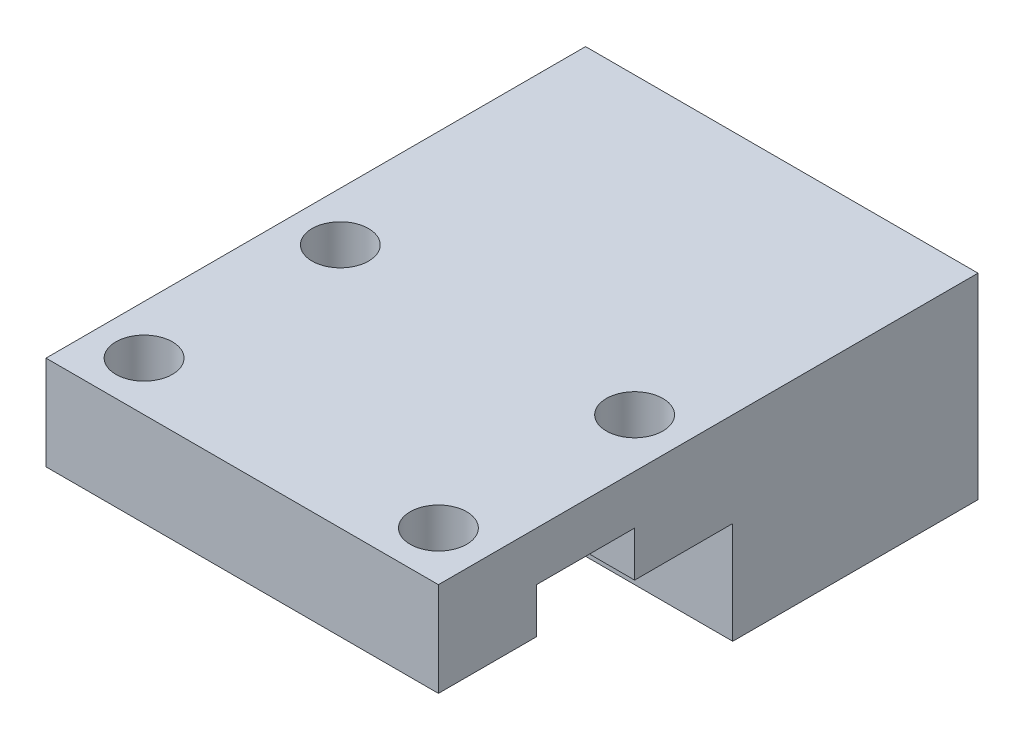
ISO-10303-21;
HEADER;
FILE_DESCRIPTION(('STEP AP214'),'2;1');
FILE_NAME('part.step','',(''),(''),'','','');
FILE_SCHEMA(('AUTOMOTIVE_DESIGN { 1 0 10303 214 1 1 1 1 }'));
ENDSEC;
DATA;
#1=APPLICATION_CONTEXT('core data for automotive mechanical design processes');
#2=APPLICATION_PROTOCOL_DEFINITION('international standard','automotive_design',2000,#1);
#3=PRODUCT_CONTEXT('',#1,'mechanical');
#4=PRODUCT('Part','Part','',(#3));
#5=PRODUCT_RELATED_PRODUCT_CATEGORY('part','',(#4));
#6=PRODUCT_DEFINITION_FORMATION('','',#4);
#7=PRODUCT_DEFINITION_CONTEXT('part definition',#1,'design');
#8=PRODUCT_DEFINITION('design','',#6,#7);
#9=PRODUCT_DEFINITION_SHAPE('','',#8);
#10=(LENGTH_UNIT() NAMED_UNIT(*) SI_UNIT(.MILLI.,.METRE.));
#11=(NAMED_UNIT(*) PLANE_ANGLE_UNIT() SI_UNIT($,.RADIAN.));
#12=(NAMED_UNIT(*) SI_UNIT($,.STERADIAN.) SOLID_ANGLE_UNIT());
#13=UNCERTAINTY_MEASURE_WITH_UNIT(LENGTH_MEASURE(1.E-05),#10,'distance_accuracy_value','');
#14=(GEOMETRIC_REPRESENTATION_CONTEXT(3) GLOBAL_UNCERTAINTY_ASSIGNED_CONTEXT((#13)) GLOBAL_UNIT_ASSIGNED_CONTEXT((#10,
#11,#12)) REPRESENTATION_CONTEXT('',''));
#15=CARTESIAN_POINT('',(0.,0.,0.));
#16=DIRECTION('',(0.,0.,1.));
#17=DIRECTION('',(1.,0.,0.));
#18=AXIS2_PLACEMENT_3D('',#15,#16,#17);
#19=CARTESIAN_POINT('',(25.4,0.,-19.05));
#20=DIRECTION('',(0.,0.,-1.));
#21=DIRECTION('',(-1.,0.,0.));
#22=AXIS2_PLACEMENT_3D('',#19,#20,#21);
#23=PLANE('',#22);
#24=DIRECTION('',(0.,-1.,0.));
#25=VECTOR('',#24,1.);
#26=CARTESIAN_POINT('',(0.,0.,-19.05));
#27=LINE('',#26,#25);
#28=CARTESIAN_POINT('',(0.,0.,-19.05));
#29=VERTEX_POINT('',#28);
#30=CARTESIAN_POINT('',(0.,-6.604,-19.05));
#31=VERTEX_POINT('',#30);
#32=EDGE_CURVE('E142',#29,#31,#27,.T.);
#33=ORIENTED_EDGE('',*,*,#32,.T.);
#34=DIRECTION('',(-1.,0.,0.));
#35=VECTOR('',#34,1.);
#36=CARTESIAN_POINT('',(25.4,-6.604,-19.05));
#37=LINE('',#36,#35);
#38=CARTESIAN_POINT('',(25.4,-6.604,-19.05));
#39=VERTEX_POINT('',#38);
#40=EDGE_CURVE('E11',#39,#31,#37,.T.);
#41=ORIENTED_EDGE('',*,*,#40,.F.);
#42=DIRECTION('',(0.,-1.,0.));
#43=VECTOR('',#42,1.);
#44=CARTESIAN_POINT('',(25.4,0.,-19.05));
#45=LINE('',#44,#43);
#46=CARTESIAN_POINT('',(25.4,0.,-19.05));
#47=VERTEX_POINT('',#46);
#48=EDGE_CURVE('E205',#47,#39,#45,.T.);
#49=ORIENTED_EDGE('',*,*,#48,.F.);
#50=DIRECTION('',(-1.,0.,0.));
#51=VECTOR('',#50,1.);
#52=CARTESIAN_POINT('',(25.4,0.,-19.05));
#53=LINE('',#52,#51);
#54=EDGE_CURVE('E137',#47,#29,#53,.T.);
#55=ORIENTED_EDGE('',*,*,#54,.T.);
#56=EDGE_LOOP('',(#33,#41,#49,#55));
#57=FACE_BOUND('',#56,.T.);
#58=ADVANCED_FACE('F35',(#57),#23,.F.);
#59=CARTESIAN_POINT('',(25.4,-6.604,0.));
#60=DIRECTION('',(0.,1.,0.));
#61=DIRECTION('',(0.,0.,1.));
#62=AXIS2_PLACEMENT_3D('',#59,#60,#61);
#63=PLANE('',#62);
#64=DIRECTION('',(0.,0.,-1.));
#65=VECTOR('',#64,1.);
#66=CARTESIAN_POINT('',(0.,-6.604,0.));
#67=LINE('',#66,#65);
#68=CARTESIAN_POINT('',(0.,-6.604,-34.925));
#69=VERTEX_POINT('',#68);
#70=EDGE_CURVE('E145',#31,#69,#67,.T.);
#71=ORIENTED_EDGE('',*,*,#70,.T.);
#72=DIRECTION('',(-1.,0.,0.));
#73=VECTOR('',#72,1.);
#74=CARTESIAN_POINT('',(25.4,-6.604,-34.925));
#75=LINE('',#74,#73);
#76=CARTESIAN_POINT('',(25.4,-6.604,-34.925));
#77=VERTEX_POINT('',#76);
#78=EDGE_CURVE('E43',#77,#69,#75,.T.);
#79=ORIENTED_EDGE('',*,*,#78,.F.);
#80=DIRECTION('',(0.,0.,-1.));
#81=VECTOR('',#80,1.);
#82=CARTESIAN_POINT('',(25.4,-6.604,0.));
#83=LINE('',#82,#81);
#84=EDGE_CURVE('E96',#39,#77,#83,.T.);
#85=ORIENTED_EDGE('',*,*,#84,.F.);
#86=ORIENTED_EDGE('',*,*,#40,.T.);
#87=EDGE_LOOP('',(#71,#79,#85,#86));
#88=FACE_BOUND('',#87,.T.);
#89=ADVANCED_FACE('F283',(#88),#63,.F.);
#90=CARTESIAN_POINT('',(25.4,0.,-34.925));
#91=DIRECTION('',(0.,0.,1.));
#92=DIRECTION('',(1.,0.,0.));
#93=AXIS2_PLACEMENT_3D('',#90,#91,#92);
#94=PLANE('',#93);
#95=CARTESIAN_POINT('',(6.35,-3.429,-34.925));
#96=DIRECTION('',(0.,0.,-1.));
#97=DIRECTION('',(-1.,0.,0.));
#98=AXIS2_PLACEMENT_3D('',#95,#96,#97);
#99=CIRCLE('',#98,1.8288);
#100=CARTESIAN_POINT('',(4.5212,-3.429,-34.925));
#101=VERTEX_POINT('',#100);
#102=EDGE_CURVE('E228',#101,#101,#99,.T.);
#103=ORIENTED_EDGE('',*,*,#102,.F.);
#104=EDGE_LOOP('',(#103));
#105=FACE_BOUND('',#104,.T.);
#106=CARTESIAN_POINT('',(19.05,-3.429,-34.925));
#107=DIRECTION('',(0.,0.,-1.));
#108=DIRECTION('',(-1.,0.,0.));
#109=AXIS2_PLACEMENT_3D('',#106,#107,#108);
#110=CIRCLE('',#109,1.8288);
#111=CARTESIAN_POINT('',(17.2212,-3.429,-34.925));
#112=VERTEX_POINT('',#111);
#113=EDGE_CURVE('E222',#112,#112,#110,.T.);
#114=ORIENTED_EDGE('',*,*,#113,.F.);
#115=EDGE_LOOP('',(#114));
#116=FACE_BOUND('',#115,.T.);
#117=CARTESIAN_POINT('',(6.35,2.921,-34.925));
#118=DIRECTION('',(0.,0.,-1.));
#119=DIRECTION('',(-1.,0.,0.));
#120=AXIS2_PLACEMENT_3D('',#117,#118,#119);
#121=CIRCLE('',#120,1.8288);
#122=CARTESIAN_POINT('',(4.5212,2.921,-34.925));
#123=VERTEX_POINT('',#122);
#124=EDGE_CURVE('E216',#123,#123,#121,.T.);
#125=ORIENTED_EDGE('',*,*,#124,.F.);
#126=EDGE_LOOP('',(#125));
#127=FACE_BOUND('',#126,.T.);
#128=CARTESIAN_POINT('',(19.05,2.921,-34.925));
#129=DIRECTION('',(0.,0.,-1.));
#130=DIRECTION('',(-1.,0.,0.));
#131=AXIS2_PLACEMENT_3D('',#128,#129,#130);
#132=CIRCLE('',#131,1.8288);
#133=CARTESIAN_POINT('',(17.2212,2.921,-34.925));
#134=VERTEX_POINT('',#133);
#135=EDGE_CURVE('E210',#134,#134,#132,.T.);
#136=ORIENTED_EDGE('',*,*,#135,.F.);
#137=EDGE_LOOP('',(#136));
#138=FACE_BOUND('',#137,.T.);
#139=DIRECTION('',(0.,1.,0.));
#140=VECTOR('',#139,1.);
#141=CARTESIAN_POINT('',(0.,0.,-34.925));
#142=LINE('',#141,#140);
#143=CARTESIAN_POINT('',(0.,6.096,-34.925));
#144=VERTEX_POINT('',#143);
#145=EDGE_CURVE('E148',#69,#144,#142,.T.);
#146=ORIENTED_EDGE('',*,*,#145,.T.);
#147=DIRECTION('',(-1.,0.,0.));
#148=VECTOR('',#147,1.);
#149=CARTESIAN_POINT('',(25.4,6.096,-34.925));
#150=LINE('',#149,#148);
#151=CARTESIAN_POINT('',(25.4,6.096,-34.925));
#152=VERTEX_POINT('',#151);
#153=EDGE_CURVE('E175',#152,#144,#150,.T.);
#154=ORIENTED_EDGE('',*,*,#153,.F.);
#155=DIRECTION('',(0.,1.,0.));
#156=VECTOR('',#155,1.);
#157=CARTESIAN_POINT('',(25.4,0.,-34.925));
#158=LINE('',#157,#156);
#159=EDGE_CURVE('E182',#77,#152,#158,.T.);
#160=ORIENTED_EDGE('',*,*,#159,.F.);
#161=ORIENTED_EDGE('',*,*,#78,.T.);
#162=EDGE_LOOP('',(#146,#154,#160,#161));
#163=FACE_BOUND('',#162,.T.);
#164=ADVANCED_FACE('F180',(#105,#116,#127,#138,#163),#94,.F.);
#165=CARTESIAN_POINT('',(25.4,6.096,0.));
#166=DIRECTION('',(0.,1.,0.));
#167=DIRECTION('',(0.,0.,1.));
#168=AXIS2_PLACEMENT_3D('',#165,#166,#167);
#169=PLANE('',#168);
#170=CARTESIAN_POINT('',(22.225,6.096,-15.875));
#171=DIRECTION('',(0.,1.,0.));
#172=DIRECTION('',(0.,0.,1.));
#173=AXIS2_PLACEMENT_3D('',#170,#171,#172);
#174=CIRCLE('',#173,1.8288);
#175=CARTESIAN_POINT('',(22.225,6.096,-14.0462));
#176=VERTEX_POINT('',#175);
#177=EDGE_CURVE('E251',#176,#176,#174,.T.);
#178=ORIENTED_EDGE('',*,*,#177,.F.);
#179=EDGE_LOOP('',(#178));
#180=FACE_BOUND('',#179,.T.);
#181=CARTESIAN_POINT('',(22.225,6.096,-3.175));
#182=DIRECTION('',(0.,1.,0.));
#183=DIRECTION('',(0.,0.,1.));
#184=AXIS2_PLACEMENT_3D('',#181,#182,#183);
#185=CIRCLE('',#184,1.82880000000001);
#186=CARTESIAN_POINT('',(22.225,6.096,-1.34619999999999));
#187=VERTEX_POINT('',#186);
#188=EDGE_CURVE('E245',#187,#187,#185,.T.);
#189=ORIENTED_EDGE('',*,*,#188,.F.);
#190=EDGE_LOOP('',(#189));
#191=FACE_BOUND('',#190,.T.);
#192=CARTESIAN_POINT('',(3.175,6.096,-15.875));
#193=DIRECTION('',(0.,1.,0.));
#194=DIRECTION('',(0.,0.,1.));
#195=AXIS2_PLACEMENT_3D('',#192,#193,#194);
#196=CIRCLE('',#195,1.8288);
#197=CARTESIAN_POINT('',(3.175,6.096,-14.0462));
#198=VERTEX_POINT('',#197);
#199=EDGE_CURVE('E239',#198,#198,#196,.T.);
#200=ORIENTED_EDGE('',*,*,#199,.F.);
#201=EDGE_LOOP('',(#200));
#202=FACE_BOUND('',#201,.T.);
#203=CARTESIAN_POINT('',(3.175,6.096,-3.175));
#204=DIRECTION('',(0.,1.,0.));
#205=DIRECTION('',(0.,0.,1.));
#206=AXIS2_PLACEMENT_3D('',#203,#204,#205);
#207=CIRCLE('',#206,1.8288);
#208=CARTESIAN_POINT('',(3.175,6.096,-1.3462));
#209=VERTEX_POINT('',#208);
#210=EDGE_CURVE('E231',#209,#209,#207,.T.);
#211=ORIENTED_EDGE('',*,*,#210,.F.);
#212=EDGE_LOOP('',(#211));
#213=FACE_BOUND('',#212,.T.);
#214=DIRECTION('',(0.,0.,-1.));
#215=VECTOR('',#214,1.);
#216=CARTESIAN_POINT('',(0.,6.096,0.));
#217=LINE('',#216,#215);
#218=CARTESIAN_POINT('',(0.,6.096,0.));
#219=VERTEX_POINT('',#218);
#220=EDGE_CURVE('E151',#219,#144,#217,.T.);
#221=ORIENTED_EDGE('',*,*,#220,.F.);
#222=DIRECTION('',(-1.,0.,0.));
#223=VECTOR('',#222,1.);
#224=CARTESIAN_POINT('',(25.4,6.096,0.));
#225=LINE('',#224,#223);
#226=CARTESIAN_POINT('',(25.4,6.096,0.));
#227=VERTEX_POINT('',#226);
#228=EDGE_CURVE('E173',#227,#219,#225,.T.);
#229=ORIENTED_EDGE('',*,*,#228,.F.);
#230=DIRECTION('',(0.,0.,-1.));
#231=VECTOR('',#230,1.);
#232=CARTESIAN_POINT('',(25.4,6.096,0.));
#233=LINE('',#232,#231);
#234=EDGE_CURVE('E193',#227,#152,#233,.T.);
#235=ORIENTED_EDGE('',*,*,#234,.T.);
#236=ORIENTED_EDGE('',*,*,#153,.T.);
#237=EDGE_LOOP('',(#221,#229,#235,#236));
#238=FACE_BOUND('',#237,.T.);
#239=ADVANCED_FACE('F190',(#180,#191,#202,#213,#238),#169,.T.);
#240=CARTESIAN_POINT('',(25.4,0.,0.));
#241=DIRECTION('',(0.,0.,1.));
#242=DIRECTION('',(1.,0.,0.));
#243=AXIS2_PLACEMENT_3D('',#240,#241,#242);
#244=PLANE('',#243);
#245=DIRECTION('',(0.,1.,0.));
#246=VECTOR('',#245,1.);
#247=CARTESIAN_POINT('',(0.,0.,0.));
#248=LINE('',#247,#246);
#249=CARTESIAN_POINT('',(0.,0.,0.));
#250=VERTEX_POINT('',#249);
#251=EDGE_CURVE('E154',#250,#219,#248,.T.);
#252=ORIENTED_EDGE('',*,*,#251,.F.);
#253=DIRECTION('',(-1.,0.,0.));
#254=VECTOR('',#253,1.);
#255=CARTESIAN_POINT('',(25.4,0.,0.));
#256=LINE('',#255,#254);
#257=CARTESIAN_POINT('',(25.4,0.,0.));
#258=VERTEX_POINT('',#257);
#259=EDGE_CURVE('E171',#258,#250,#256,.T.);
#260=ORIENTED_EDGE('',*,*,#259,.F.);
#261=DIRECTION('',(0.,1.,0.));
#262=VECTOR('',#261,1.);
#263=CARTESIAN_POINT('',(25.4,0.,0.));
#264=LINE('',#263,#262);
#265=EDGE_CURVE('E196',#258,#227,#264,.T.);
#266=ORIENTED_EDGE('',*,*,#265,.T.);
#267=ORIENTED_EDGE('',*,*,#228,.T.);
#268=EDGE_LOOP('',(#252,#260,#266,#267));
#269=FACE_BOUND('',#268,.T.);
#270=ADVANCED_FACE('F296',(#269),#244,.T.);
#271=CARTESIAN_POINT('',(25.4,0.,0.));
#272=DIRECTION('',(0.,1.,0.));
#273=DIRECTION('',(0.,0.,1.));
#274=AXIS2_PLACEMENT_3D('',#271,#272,#273);
#275=PLANE('',#274);
#276=CARTESIAN_POINT('',(22.225,0.,-3.175));
#277=DIRECTION('',(0.,-1.,0.));
#278=DIRECTION('',(0.,0.,-1.));
#279=AXIS2_PLACEMENT_3D('',#276,#277,#278);
#280=CIRCLE('',#279,1.82880000000001);
#281=CARTESIAN_POINT('',(22.225,0.,-5.00380000000001));
#282=VERTEX_POINT('',#281);
#283=EDGE_CURVE('E248',#282,#282,#280,.T.);
#284=ORIENTED_EDGE('',*,*,#283,.F.);
#285=EDGE_LOOP('',(#284));
#286=FACE_BOUND('',#285,.T.);
#287=CARTESIAN_POINT('',(3.175,0.,-3.175));
#288=DIRECTION('',(0.,-1.,0.));
#289=DIRECTION('',(0.,0.,-1.));
#290=AXIS2_PLACEMENT_3D('',#287,#288,#289);
#291=CIRCLE('',#290,1.8288);
#292=CARTESIAN_POINT('',(3.175,0.,-5.0038));
#293=VERTEX_POINT('',#292);
#294=EDGE_CURVE('E236',#293,#293,#291,.T.);
#295=ORIENTED_EDGE('',*,*,#294,.F.);
#296=EDGE_LOOP('',(#295));
#297=FACE_BOUND('',#296,.T.);
#298=DIRECTION('',(0.,0.,-1.));
#299=VECTOR('',#298,1.);
#300=CARTESIAN_POINT('',(0.,0.,0.));
#301=LINE('',#300,#299);
#302=CARTESIAN_POINT('',(0.,0.,-6.35));
#303=VERTEX_POINT('',#302);
#304=EDGE_CURVE('E157',#250,#303,#301,.T.);
#305=ORIENTED_EDGE('',*,*,#304,.T.);
#306=DIRECTION('',(-1.,0.,0.));
#307=VECTOR('',#306,1.);
#308=CARTESIAN_POINT('',(25.4,0.,-6.35));
#309=LINE('',#308,#307);
#310=CARTESIAN_POINT('',(25.4,0.,-6.35));
#311=VERTEX_POINT('',#310);
#312=EDGE_CURVE('E169',#311,#303,#309,.T.);
#313=ORIENTED_EDGE('',*,*,#312,.F.);
#314=DIRECTION('',(0.,0.,-1.));
#315=VECTOR('',#314,1.);
#316=CARTESIAN_POINT('',(25.4,0.,0.));
#317=LINE('',#316,#315);
#318=EDGE_CURVE('E139',#258,#311,#317,.T.);
#319=ORIENTED_EDGE('',*,*,#318,.F.);
#320=ORIENTED_EDGE('',*,*,#259,.T.);
#321=EDGE_LOOP('',(#305,#313,#319,#320));
#322=FACE_BOUND('',#321,.T.);
#323=ADVANCED_FACE('F264',(#286,#297,#322),#275,.F.);
#324=CARTESIAN_POINT('',(25.4,0.,-6.35));
#325=DIRECTION('',(0.,0.,-1.));
#326=DIRECTION('',(0.,1.,0.));
#327=AXIS2_PLACEMENT_3D('',#324,#325,#326);
#328=PLANE('',#327);
#329=DIRECTION('',(0.,-1.,0.));
#330=VECTOR('',#329,1.);
#331=CARTESIAN_POINT('',(0.,0.,-6.35));
#332=LINE('',#331,#330);
#333=CARTESIAN_POINT('',(0.,2.921,-6.35));
#334=VERTEX_POINT('',#333);
#335=EDGE_CURVE('E160',#334,#303,#332,.T.);
#336=ORIENTED_EDGE('',*,*,#335,.F.);
#337=DIRECTION('',(-1.,0.,0.));
#338=VECTOR('',#337,1.);
#339=CARTESIAN_POINT('',(25.4,2.921,-6.35));
#340=LINE('',#339,#338);
#341=CARTESIAN_POINT('',(25.4,2.921,-6.35));
#342=VERTEX_POINT('',#341);
#343=EDGE_CURVE('E127',#342,#334,#340,.T.);
#344=ORIENTED_EDGE('',*,*,#343,.F.);
#345=DIRECTION('',(0.,-1.,0.));
#346=VECTOR('',#345,1.);
#347=CARTESIAN_POINT('',(25.4,0.,-6.35));
#348=LINE('',#347,#346);
#349=EDGE_CURVE('E133',#342,#311,#348,.T.);
#350=ORIENTED_EDGE('',*,*,#349,.T.);
#351=ORIENTED_EDGE('',*,*,#312,.T.);
#352=EDGE_LOOP('',(#336,#344,#350,#351));
#353=FACE_BOUND('',#352,.T.);
#354=ADVANCED_FACE('F203',(#353),#328,.T.);
#355=CARTESIAN_POINT('',(25.4,2.921,0.));
#356=DIRECTION('',(0.,-1.,0.));
#357=DIRECTION('',(0.,0.,-1.));
#358=AXIS2_PLACEMENT_3D('',#355,#356,#357);
#359=PLANE('',#358);
#360=DIRECTION('',(0.,0.,1.));
#361=VECTOR('',#360,1.);
#362=CARTESIAN_POINT('',(0.,2.921,0.));
#363=LINE('',#362,#361);
#364=CARTESIAN_POINT('',(0.,2.921,-12.7));
#365=VERTEX_POINT('',#364);
#366=EDGE_CURVE('E122',#365,#334,#363,.T.);
#367=ORIENTED_EDGE('',*,*,#366,.F.);
#368=DIRECTION('',(-1.,0.,0.));
#369=VECTOR('',#368,1.);
#370=CARTESIAN_POINT('',(25.4,2.921,-12.7));
#371=LINE('',#370,#369);
#372=CARTESIAN_POINT('',(25.4,2.921,-12.7));
#373=VERTEX_POINT('',#372);
#374=EDGE_CURVE('E117',#373,#365,#371,.T.);
#375=ORIENTED_EDGE('',*,*,#374,.F.);
#376=DIRECTION('',(0.,0.,1.));
#377=VECTOR('',#376,1.);
#378=CARTESIAN_POINT('',(25.4,2.921,0.));
#379=LINE('',#378,#377);
#380=EDGE_CURVE('E120',#373,#342,#379,.T.);
#381=ORIENTED_EDGE('',*,*,#380,.T.);
#382=ORIENTED_EDGE('',*,*,#343,.T.);
#383=EDGE_LOOP('',(#367,#375,#381,#382));
#384=FACE_BOUND('',#383,.T.);
#385=ADVANCED_FACE('F119',(#384),#359,.T.);
#386=CARTESIAN_POINT('',(25.4,0.,-12.7));
#387=DIRECTION('',(0.,0.,1.));
#388=DIRECTION('',(0.,-1.,0.));
#389=AXIS2_PLACEMENT_3D('',#386,#387,#388);
#390=PLANE('',#389);
#391=DIRECTION('',(0.,1.,0.));
#392=VECTOR('',#391,1.);
#393=CARTESIAN_POINT('',(0.,0.,-12.7));
#394=LINE('',#393,#392);
#395=CARTESIAN_POINT('',(0.,0.,-12.7));
#396=VERTEX_POINT('',#395);
#397=EDGE_CURVE('E164',#396,#365,#394,.T.);
#398=ORIENTED_EDGE('',*,*,#397,.F.);
#399=DIRECTION('',(-1.,0.,0.));
#400=VECTOR('',#399,1.);
#401=CARTESIAN_POINT('',(25.4,0.,-12.7));
#402=LINE('',#401,#400);
#403=CARTESIAN_POINT('',(25.4,0.,-12.7));
#404=VERTEX_POINT('',#403);
#405=EDGE_CURVE('E85',#404,#396,#402,.T.);
#406=ORIENTED_EDGE('',*,*,#405,.F.);
#407=DIRECTION('',(0.,1.,0.));
#408=VECTOR('',#407,1.);
#409=CARTESIAN_POINT('',(25.4,0.,-12.7));
#410=LINE('',#409,#408);
#411=EDGE_CURVE('E131',#404,#373,#410,.T.);
#412=ORIENTED_EDGE('',*,*,#411,.T.);
#413=ORIENTED_EDGE('',*,*,#374,.T.);
#414=EDGE_LOOP('',(#398,#406,#412,#413));
#415=FACE_BOUND('',#414,.T.);
#416=ADVANCED_FACE('F135',(#415),#390,.T.);
#417=CARTESIAN_POINT('',(22.225,0.,-15.875));
#418=DIRECTION('',(0.,-1.,0.));
#419=DIRECTION('',(0.,0.,-1.));
#420=AXIS2_PLACEMENT_3D('',#417,#418,#419);
#421=CIRCLE('',#420,1.8288);
#422=CARTESIAN_POINT('',(22.225,0.,-17.7038));
#423=VERTEX_POINT('',#422);
#424=EDGE_CURVE('E254',#423,#423,#421,.T.);
#425=ORIENTED_EDGE('',*,*,#424,.F.);
#426=EDGE_LOOP('',(#425));
#427=FACE_BOUND('',#426,.T.);
#428=CARTESIAN_POINT('',(3.175,0.,-15.875));
#429=DIRECTION('',(0.,-1.,0.));
#430=DIRECTION('',(0.,0.,-1.));
#431=AXIS2_PLACEMENT_3D('',#428,#429,#430);
#432=CIRCLE('',#431,1.8288);
#433=CARTESIAN_POINT('',(3.175,0.,-17.7038));
#434=VERTEX_POINT('',#433);
#435=EDGE_CURVE('E242',#434,#434,#432,.T.);
#436=ORIENTED_EDGE('',*,*,#435,.F.);
#437=EDGE_LOOP('',(#436));
#438=FACE_BOUND('',#437,.T.);
#439=EDGE_CURVE('E88',#396,#29,#301,.T.);
#440=ORIENTED_EDGE('',*,*,#439,.T.);
#441=ORIENTED_EDGE('',*,*,#54,.F.);
#442=EDGE_CURVE('E51',#404,#47,#317,.T.);
#443=ORIENTED_EDGE('',*,*,#442,.F.);
#444=ORIENTED_EDGE('',*,*,#405,.T.);
#445=EDGE_LOOP('',(#440,#441,#443,#444));
#446=FACE_BOUND('',#445,.T.);
#447=ADVANCED_FACE('F260',(#427,#438,#446),#275,.F.);
#448=CARTESIAN_POINT('',(25.4,0.,0.));
#449=DIRECTION('',(1.,0.,0.));
#450=DIRECTION('',(0.,0.,-1.));
#451=AXIS2_PLACEMENT_3D('',#448,#449,#450);
#452=PLANE('',#451);
#453=ORIENTED_EDGE('',*,*,#48,.T.);
#454=ORIENTED_EDGE('',*,*,#84,.T.);
#455=ORIENTED_EDGE('',*,*,#159,.T.);
#456=ORIENTED_EDGE('',*,*,#234,.F.);
#457=ORIENTED_EDGE('',*,*,#265,.F.);
#458=ORIENTED_EDGE('',*,*,#318,.T.);
#459=ORIENTED_EDGE('',*,*,#349,.F.);
#460=ORIENTED_EDGE('',*,*,#380,.F.);
#461=ORIENTED_EDGE('',*,*,#411,.F.);
#462=ORIENTED_EDGE('',*,*,#442,.T.);
#463=EDGE_LOOP('',(#453,#454,#455,#456,#457,#458,#459,#460,#461,#462));
#464=FACE_BOUND('',#463,.T.);
#465=ADVANCED_FACE('F130',(#464),#452,.T.);
#466=CARTESIAN_POINT('',(0.,0.,0.));
#467=DIRECTION('',(1.,0.,0.));
#468=DIRECTION('',(0.,0.,-1.));
#469=AXIS2_PLACEMENT_3D('',#466,#467,#468);
#470=PLANE('',#469);
#471=ORIENTED_EDGE('',*,*,#32,.F.);
#472=ORIENTED_EDGE('',*,*,#439,.F.);
#473=ORIENTED_EDGE('',*,*,#397,.T.);
#474=ORIENTED_EDGE('',*,*,#366,.T.);
#475=ORIENTED_EDGE('',*,*,#335,.T.);
#476=ORIENTED_EDGE('',*,*,#304,.F.);
#477=ORIENTED_EDGE('',*,*,#251,.T.);
#478=ORIENTED_EDGE('',*,*,#220,.T.);
#479=ORIENTED_EDGE('',*,*,#145,.F.);
#480=ORIENTED_EDGE('',*,*,#70,.F.);
#481=EDGE_LOOP('',(#471,#472,#473,#474,#475,#476,#477,#478,#479,#480));
#482=FACE_BOUND('',#481,.T.);
#483=ADVANCED_FACE('F185',(#482),#470,.F.);
#484=CARTESIAN_POINT('',(19.05,2.921,-22.225));
#485=DIRECTION('',(0.,0.,-1.));
#486=DIRECTION('',(-1.,0.,0.));
#487=AXIS2_PLACEMENT_3D('',#484,#485,#486);
#488=CYLINDRICAL_SURFACE('',#487,1.8288);
#489=CARTESIAN_POINT('',(19.05,2.921,-22.225));
#490=DIRECTION('',(0.,0.,-1.));
#491=DIRECTION('',(-1.,0.,0.));
#492=AXIS2_PLACEMENT_3D('',#489,#490,#491);
#493=CIRCLE('',#492,1.8288);
#494=CARTESIAN_POINT('',(17.2212,2.921,-22.225));
#495=VERTEX_POINT('',#494);
#496=EDGE_CURVE('E146',#495,#495,#493,.T.);
#497=ORIENTED_EDGE('',*,*,#496,.F.);
#498=EDGE_LOOP('',(#497));
#499=FACE_BOUND('',#498,.T.);
#500=ORIENTED_EDGE('',*,*,#135,.T.);
#501=EDGE_LOOP('',(#500));
#502=FACE_BOUND('',#501,.T.);
#503=ADVANCED_FACE('F309',(#499,#502),#488,.F.);
#504=CARTESIAN_POINT('',(19.05,2.921,-22.225));
#505=DIRECTION('',(0.,0.,-1.));
#506=DIRECTION('',(-1.,0.,0.));
#507=AXIS2_PLACEMENT_3D('',#504,#505,#506);
#508=PLANE('',#507);
#509=ORIENTED_EDGE('',*,*,#496,.T.);
#510=EDGE_LOOP('',(#509));
#511=FACE_BOUND('',#510,.T.);
#512=ADVANCED_FACE('F314',(#511),#508,.T.);
#513=CARTESIAN_POINT('',(6.35,2.921,-22.225));
#514=DIRECTION('',(0.,0.,-1.));
#515=DIRECTION('',(-1.,0.,0.));
#516=AXIS2_PLACEMENT_3D('',#513,#514,#515);
#517=CYLINDRICAL_SURFACE('',#516,1.8288);
#518=CARTESIAN_POINT('',(6.35,2.921,-22.225));
#519=DIRECTION('',(0.,0.,-1.));
#520=DIRECTION('',(-1.,0.,0.));
#521=AXIS2_PLACEMENT_3D('',#518,#519,#520);
#522=CIRCLE('',#521,1.8288);
#523=CARTESIAN_POINT('',(4.5212,2.921,-22.225));
#524=VERTEX_POINT('',#523);
#525=EDGE_CURVE('E213',#524,#524,#522,.T.);
#526=ORIENTED_EDGE('',*,*,#525,.F.);
#527=EDGE_LOOP('',(#526));
#528=FACE_BOUND('',#527,.T.);
#529=ORIENTED_EDGE('',*,*,#124,.T.);
#530=EDGE_LOOP('',(#529));
#531=FACE_BOUND('',#530,.T.);
#532=ADVANCED_FACE('F318',(#528,#531),#517,.F.);
#533=CARTESIAN_POINT('',(6.35,2.921,-22.225));
#534=DIRECTION('',(0.,0.,-1.));
#535=DIRECTION('',(-1.,0.,0.));
#536=AXIS2_PLACEMENT_3D('',#533,#534,#535);
#537=PLANE('',#536);
#538=ORIENTED_EDGE('',*,*,#525,.T.);
#539=EDGE_LOOP('',(#538));
#540=FACE_BOUND('',#539,.T.);
#541=ADVANCED_FACE('F322',(#540),#537,.T.);
#542=CARTESIAN_POINT('',(19.05,-3.429,-22.225));
#543=DIRECTION('',(0.,0.,-1.));
#544=DIRECTION('',(-1.,0.,0.));
#545=AXIS2_PLACEMENT_3D('',#542,#543,#544);
#546=CYLINDRICAL_SURFACE('',#545,1.8288);
#547=CARTESIAN_POINT('',(19.05,-3.429,-22.225));
#548=DIRECTION('',(0.,0.,-1.));
#549=DIRECTION('',(-1.,0.,0.));
#550=AXIS2_PLACEMENT_3D('',#547,#548,#549);
#551=CIRCLE('',#550,1.8288);
#552=CARTESIAN_POINT('',(17.2212,-3.429,-22.225));
#553=VERTEX_POINT('',#552);
#554=EDGE_CURVE('E219',#553,#553,#551,.T.);
#555=ORIENTED_EDGE('',*,*,#554,.F.);
#556=EDGE_LOOP('',(#555));
#557=FACE_BOUND('',#556,.T.);
#558=ORIENTED_EDGE('',*,*,#113,.T.);
#559=EDGE_LOOP('',(#558));
#560=FACE_BOUND('',#559,.T.);
#561=ADVANCED_FACE('F326',(#557,#560),#546,.F.);
#562=CARTESIAN_POINT('',(19.05,-3.429,-22.225));
#563=DIRECTION('',(0.,0.,-1.));
#564=DIRECTION('',(-1.,0.,0.));
#565=AXIS2_PLACEMENT_3D('',#562,#563,#564);
#566=PLANE('',#565);
#567=ORIENTED_EDGE('',*,*,#554,.T.);
#568=EDGE_LOOP('',(#567));
#569=FACE_BOUND('',#568,.T.);
#570=ADVANCED_FACE('F330',(#569),#566,.T.);
#571=CARTESIAN_POINT('',(6.35,-3.429,-22.225));
#572=DIRECTION('',(0.,0.,-1.));
#573=DIRECTION('',(-1.,0.,0.));
#574=AXIS2_PLACEMENT_3D('',#571,#572,#573);
#575=CYLINDRICAL_SURFACE('',#574,1.8288);
#576=CARTESIAN_POINT('',(6.35,-3.429,-22.225));
#577=DIRECTION('',(0.,0.,-1.));
#578=DIRECTION('',(-1.,0.,0.));
#579=AXIS2_PLACEMENT_3D('',#576,#577,#578);
#580=CIRCLE('',#579,1.8288);
#581=CARTESIAN_POINT('',(4.5212,-3.429,-22.225));
#582=VERTEX_POINT('',#581);
#583=EDGE_CURVE('E225',#582,#582,#580,.T.);
#584=ORIENTED_EDGE('',*,*,#583,.F.);
#585=EDGE_LOOP('',(#584));
#586=FACE_BOUND('',#585,.T.);
#587=ORIENTED_EDGE('',*,*,#102,.T.);
#588=EDGE_LOOP('',(#587));
#589=FACE_BOUND('',#588,.T.);
#590=ADVANCED_FACE('F334',(#586,#589),#575,.F.);
#591=CARTESIAN_POINT('',(6.35,-3.429,-22.225));
#592=DIRECTION('',(0.,0.,-1.));
#593=DIRECTION('',(-1.,0.,0.));
#594=AXIS2_PLACEMENT_3D('',#591,#592,#593);
#595=PLANE('',#594);
#596=ORIENTED_EDGE('',*,*,#583,.T.);
#597=EDGE_LOOP('',(#596));
#598=FACE_BOUND('',#597,.T.);
#599=ADVANCED_FACE('F279',(#598),#595,.T.);
#600=CARTESIAN_POINT('',(3.175,12.7,-3.175));
#601=DIRECTION('',(0.,-1.,0.));
#602=DIRECTION('',(0.,0.,-1.));
#603=AXIS2_PLACEMENT_3D('',#600,#601,#602);
#604=CYLINDRICAL_SURFACE('',#603,1.8288);
#605=ORIENTED_EDGE('',*,*,#210,.T.);
#606=EDGE_LOOP('',(#605));
#607=FACE_BOUND('',#606,.T.);
#608=ORIENTED_EDGE('',*,*,#294,.T.);
#609=EDGE_LOOP('',(#608));
#610=FACE_BOUND('',#609,.T.);
#611=ADVANCED_FACE('F270',(#607,#610),#604,.F.);
#612=CARTESIAN_POINT('',(3.175,12.7,-15.875));
#613=DIRECTION('',(0.,-1.,0.));
#614=DIRECTION('',(0.,0.,-1.));
#615=AXIS2_PLACEMENT_3D('',#612,#613,#614);
#616=CYLINDRICAL_SURFACE('',#615,1.8288);
#617=ORIENTED_EDGE('',*,*,#199,.T.);
#618=EDGE_LOOP('',(#617));
#619=FACE_BOUND('',#618,.T.);
#620=ORIENTED_EDGE('',*,*,#435,.T.);
#621=EDGE_LOOP('',(#620));
#622=FACE_BOUND('',#621,.T.);
#623=ADVANCED_FACE('F267',(#619,#622),#616,.F.);
#624=CARTESIAN_POINT('',(22.225,12.7,-3.175));
#625=DIRECTION('',(0.,-1.,0.));
#626=DIRECTION('',(0.,0.,-1.));
#627=AXIS2_PLACEMENT_3D('',#624,#625,#626);
#628=CYLINDRICAL_SURFACE('',#627,1.82880000000001);
#629=ORIENTED_EDGE('',*,*,#188,.T.);
#630=EDGE_LOOP('',(#629));
#631=FACE_BOUND('',#630,.T.);
#632=ORIENTED_EDGE('',*,*,#283,.T.);
#633=EDGE_LOOP('',(#632));
#634=FACE_BOUND('',#633,.T.);
#635=ADVANCED_FACE('F269',(#631,#634),#628,.F.);
#636=CARTESIAN_POINT('',(22.225,12.7,-15.875));
#637=DIRECTION('',(0.,-1.,0.));
#638=DIRECTION('',(0.,0.,-1.));
#639=AXIS2_PLACEMENT_3D('',#636,#637,#638);
#640=CYLINDRICAL_SURFACE('',#639,1.8288);
#641=ORIENTED_EDGE('',*,*,#177,.T.);
#642=EDGE_LOOP('',(#641));
#643=FACE_BOUND('',#642,.T.);
#644=ORIENTED_EDGE('',*,*,#424,.T.);
#645=EDGE_LOOP('',(#644));
#646=FACE_BOUND('',#645,.T.);
#647=ADVANCED_FACE('F258',(#643,#646),#640,.F.);
#648=CLOSED_SHELL('',(#58,#89,#164,#239,#270,#323,#354,#385,#416,#447,#465,#483,#503,#512,#532,
#541,#561,#570,#590,#599,#611,#623,#635,#647));
#649=MANIFOLD_SOLID_BREP('B2',#648);
#650=ADVANCED_BREP_SHAPE_REPRESENTATION('',(#18,#649),#14);
#651=SHAPE_DEFINITION_REPRESENTATION(#9,#650);
ENDSEC;
END-ISO-10303-21;
